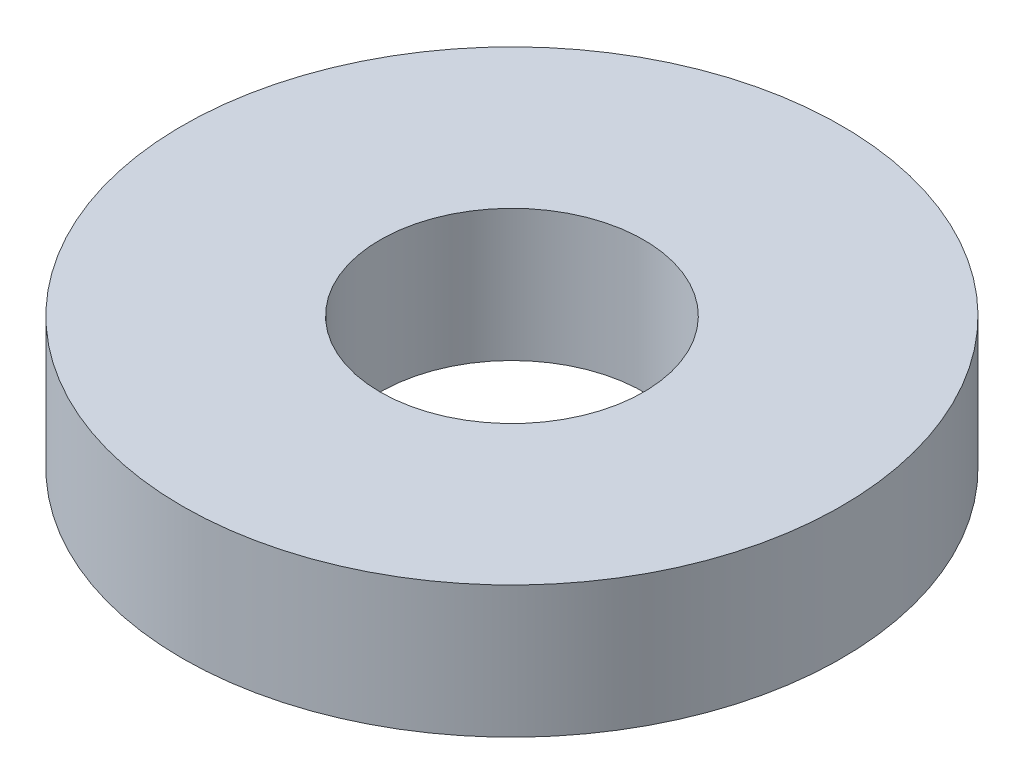
ISO-10303-21;
HEADER;
FILE_DESCRIPTION(('STEP AP214'),'2;1');
FILE_NAME('part.step','',(''),(''),'','','');
FILE_SCHEMA(('AUTOMOTIVE_DESIGN { 1 0 10303 214 1 1 1 1 }'));
ENDSEC;
DATA;
#1=APPLICATION_CONTEXT('core data for automotive mechanical design processes');
#2=APPLICATION_PROTOCOL_DEFINITION('international standard','automotive_design',2000,#1);
#3=PRODUCT_CONTEXT('',#1,'mechanical');
#4=PRODUCT('Part','Part','',(#3));
#5=PRODUCT_RELATED_PRODUCT_CATEGORY('part','',(#4));
#6=PRODUCT_DEFINITION_FORMATION('','',#4);
#7=PRODUCT_DEFINITION_CONTEXT('part definition',#1,'design');
#8=PRODUCT_DEFINITION('design','',#6,#7);
#9=PRODUCT_DEFINITION_SHAPE('','',#8);
#10=(LENGTH_UNIT() NAMED_UNIT(*) SI_UNIT(.MILLI.,.METRE.));
#11=(NAMED_UNIT(*) PLANE_ANGLE_UNIT() SI_UNIT($,.RADIAN.));
#12=(NAMED_UNIT(*) SI_UNIT($,.STERADIAN.) SOLID_ANGLE_UNIT());
#13=UNCERTAINTY_MEASURE_WITH_UNIT(LENGTH_MEASURE(1.E-05),#10,'distance_accuracy_value','');
#14=(GEOMETRIC_REPRESENTATION_CONTEXT(3) GLOBAL_UNCERTAINTY_ASSIGNED_CONTEXT((#13)) GLOBAL_UNIT_ASSIGNED_CONTEXT((#10,
#11,#12)) REPRESENTATION_CONTEXT('',''));
#15=CARTESIAN_POINT('',(0.,0.,0.));
#16=DIRECTION('',(0.,0.,1.));
#17=DIRECTION('',(1.,0.,0.));
#18=AXIS2_PLACEMENT_3D('',#15,#16,#17);
#19=CARTESIAN_POINT('',(0.,2.,0.));
#20=DIRECTION('',(0.,1.,0.));
#21=DIRECTION('',(0.,0.,1.));
#22=AXIS2_PLACEMENT_3D('',#19,#20,#21);
#23=PLANE('',#22);
#24=CARTESIAN_POINT('',(0.,2.,0.));
#25=DIRECTION('',(0.,1.,0.));
#26=DIRECTION('',(0.,0.,1.));
#27=AXIS2_PLACEMENT_3D('',#24,#25,#26);
#28=CIRCLE('',#27,5.);
#29=CARTESIAN_POINT('',(0.,2.,5.));
#30=VERTEX_POINT('',#29);
#31=EDGE_CURVE('E10',#30,#30,#28,.T.);
#32=ORIENTED_EDGE('',*,*,#31,.T.);
#33=EDGE_LOOP('',(#32));
#34=FACE_BOUND('',#33,.T.);
#35=CARTESIAN_POINT('',(0.,2.,0.));
#36=DIRECTION('',(0.,1.,0.));
#37=DIRECTION('',(0.,0.,1.));
#38=AXIS2_PLACEMENT_3D('',#35,#36,#37);
#39=CIRCLE('',#38,2.);
#40=CARTESIAN_POINT('',(0.,2.,2.));
#41=VERTEX_POINT('',#40);
#42=EDGE_CURVE('E45',#41,#41,#39,.T.);
#43=ORIENTED_EDGE('',*,*,#42,.F.);
#44=EDGE_LOOP('',(#43));
#45=FACE_BOUND('',#44,.T.);
#46=ADVANCED_FACE('F34',(#34,#45),#23,.T.);
#47=CARTESIAN_POINT('',(0.,0.,0.));
#48=DIRECTION('',(0.,1.,0.));
#49=DIRECTION('',(0.,0.,1.));
#50=AXIS2_PLACEMENT_3D('',#47,#48,#49);
#51=PLANE('',#50);
#52=CARTESIAN_POINT('',(0.,0.,0.));
#53=DIRECTION('',(0.,1.,0.));
#54=DIRECTION('',(0.,0.,1.));
#55=AXIS2_PLACEMENT_3D('',#52,#53,#54);
#56=CIRCLE('',#55,5.);
#57=CARTESIAN_POINT('',(0.,0.,5.));
#58=VERTEX_POINT('',#57);
#59=EDGE_CURVE('E38',#58,#58,#56,.T.);
#60=ORIENTED_EDGE('',*,*,#59,.F.);
#61=EDGE_LOOP('',(#60));
#62=FACE_BOUND('',#61,.T.);
#63=CARTESIAN_POINT('',(0.,0.,0.));
#64=DIRECTION('',(0.,1.,0.));
#65=DIRECTION('',(0.,0.,1.));
#66=AXIS2_PLACEMENT_3D('',#63,#64,#65);
#67=CIRCLE('',#66,2.);
#68=CARTESIAN_POINT('',(0.,0.,2.));
#69=VERTEX_POINT('',#68);
#70=EDGE_CURVE('E47',#69,#69,#67,.T.);
#71=ORIENTED_EDGE('',*,*,#70,.T.);
#72=EDGE_LOOP('',(#71));
#73=FACE_BOUND('',#72,.T.);
#74=ADVANCED_FACE('F57',(#62,#73),#51,.F.);
#75=CARTESIAN_POINT('',(0.,2.,0.));
#76=DIRECTION('',(0.,-1.,0.));
#77=DIRECTION('',(0.,0.,-1.));
#78=AXIS2_PLACEMENT_3D('',#75,#76,#77);
#79=CYLINDRICAL_SURFACE('',#78,5.);
#80=ORIENTED_EDGE('',*,*,#31,.F.);
#81=EDGE_LOOP('',(#80));
#82=FACE_BOUND('',#81,.T.);
#83=ORIENTED_EDGE('',*,*,#59,.T.);
#84=EDGE_LOOP('',(#83));
#85=FACE_BOUND('',#84,.T.);
#86=ADVANCED_FACE('F36',(#82,#85),#79,.T.);
#87=CARTESIAN_POINT('',(0.,2.,0.));
#88=DIRECTION('',(0.,-1.,0.));
#89=DIRECTION('',(0.,0.,-1.));
#90=AXIS2_PLACEMENT_3D('',#87,#88,#89);
#91=CYLINDRICAL_SURFACE('',#90,2.);
#92=ORIENTED_EDGE('',*,*,#42,.T.);
#93=EDGE_LOOP('',(#92));
#94=FACE_BOUND('',#93,.T.);
#95=ORIENTED_EDGE('',*,*,#70,.F.);
#96=EDGE_LOOP('',(#95));
#97=FACE_BOUND('',#96,.T.);
#98=ADVANCED_FACE('F53',(#94,#97),#91,.F.);
#99=CLOSED_SHELL('',(#46,#74,#86,#98));
#100=MANIFOLD_SOLID_BREP('B2',#99);
#101=ADVANCED_BREP_SHAPE_REPRESENTATION('',(#18,#100),#14);
#102=SHAPE_DEFINITION_REPRESENTATION(#9,#101);
ENDSEC;
END-ISO-10303-21;
